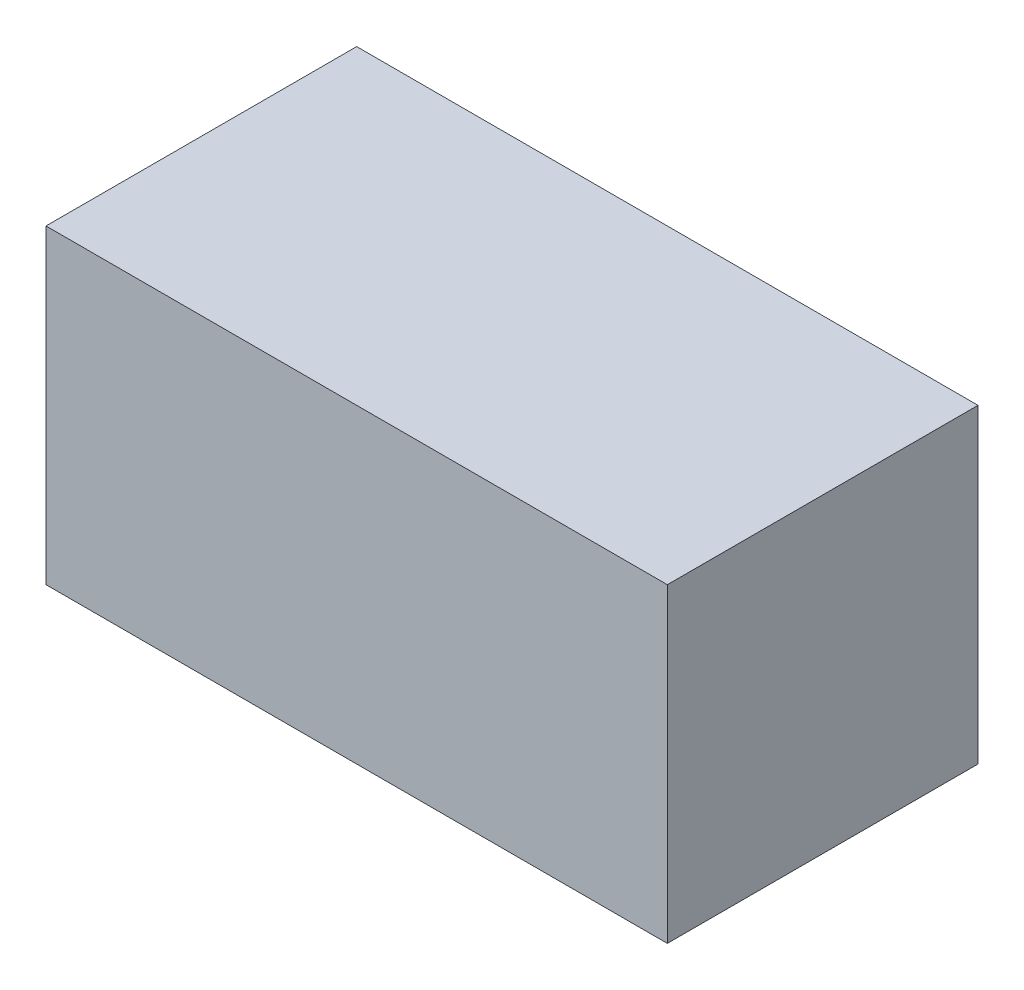
ISO-10303-21;
HEADER;
FILE_DESCRIPTION(('STEP AP214'),'2;1');
FILE_NAME('part.step','',(''),(''),'','','');
FILE_SCHEMA(('AUTOMOTIVE_DESIGN { 1 0 10303 214 1 1 1 1 }'));
ENDSEC;
DATA;
#1=APPLICATION_CONTEXT('core data for automotive mechanical design processes');
#2=APPLICATION_PROTOCOL_DEFINITION('international standard','automotive_design',2000,#1);
#3=PRODUCT_CONTEXT('',#1,'mechanical');
#4=PRODUCT('Part','Part','',(#3));
#5=PRODUCT_RELATED_PRODUCT_CATEGORY('part','',(#4));
#6=PRODUCT_DEFINITION_FORMATION('','',#4);
#7=PRODUCT_DEFINITION_CONTEXT('part definition',#1,'design');
#8=PRODUCT_DEFINITION('design','',#6,#7);
#9=PRODUCT_DEFINITION_SHAPE('','',#8);
#10=(LENGTH_UNIT() NAMED_UNIT(*) SI_UNIT(.MILLI.,.METRE.));
#11=(NAMED_UNIT(*) PLANE_ANGLE_UNIT() SI_UNIT($,.RADIAN.));
#12=(NAMED_UNIT(*) SI_UNIT($,.STERADIAN.) SOLID_ANGLE_UNIT());
#13=UNCERTAINTY_MEASURE_WITH_UNIT(LENGTH_MEASURE(1.E-05),#10,'distance_accuracy_value','');
#14=(GEOMETRIC_REPRESENTATION_CONTEXT(3) GLOBAL_UNCERTAINTY_ASSIGNED_CONTEXT((#13)) GLOBAL_UNIT_ASSIGNED_CONTEXT((#10,
#11,#12)) REPRESENTATION_CONTEXT('',''));
#15=CARTESIAN_POINT('',(0.,0.,0.));
#16=DIRECTION('',(0.,0.,1.));
#17=DIRECTION('',(1.,0.,0.));
#18=AXIS2_PLACEMENT_3D('',#15,#16,#17);
#19=CARTESIAN_POINT('',(10.,5.,5.));
#20=DIRECTION('',(-1.,0.,0.));
#21=DIRECTION('',(0.,0.,1.));
#22=AXIS2_PLACEMENT_3D('',#19,#20,#21);
#23=PLANE('',#22);
#24=DIRECTION('',(0.,0.,-1.));
#25=VECTOR('',#24,1.);
#26=CARTESIAN_POINT('',(10.,-5.,5.));
#27=LINE('',#26,#25);
#28=CARTESIAN_POINT('',(10.,-5.,5.));
#29=VERTEX_POINT('',#28);
#30=CARTESIAN_POINT('',(10.,-5.,-5.));
#31=VERTEX_POINT('',#30);
#32=EDGE_CURVE('E96',#29,#31,#27,.T.);
#33=ORIENTED_EDGE('',*,*,#32,.T.);
#34=DIRECTION('',(0.,-1.,0.));
#35=VECTOR('',#34,1.);
#36=CARTESIAN_POINT('',(10.,5.,-5.));
#37=LINE('',#36,#35);
#38=CARTESIAN_POINT('',(10.,5.,-5.));
#39=VERTEX_POINT('',#38);
#40=EDGE_CURVE('E11',#39,#31,#37,.T.);
#41=ORIENTED_EDGE('',*,*,#40,.F.);
#42=DIRECTION('',(0.,0.,-1.));
#43=VECTOR('',#42,1.);
#44=CARTESIAN_POINT('',(10.,5.,5.));
#45=LINE('',#44,#43);
#46=CARTESIAN_POINT('',(10.,5.,5.));
#47=VERTEX_POINT('',#46);
#48=EDGE_CURVE('E84',#47,#39,#45,.T.);
#49=ORIENTED_EDGE('',*,*,#48,.F.);
#50=DIRECTION('',(0.,-1.,0.));
#51=VECTOR('',#50,1.);
#52=CARTESIAN_POINT('',(10.,5.,5.));
#53=LINE('',#52,#51);
#54=EDGE_CURVE('E92',#47,#29,#53,.T.);
#55=ORIENTED_EDGE('',*,*,#54,.T.);
#56=EDGE_LOOP('',(#33,#41,#49,#55));
#57=FACE_BOUND('',#56,.T.);
#58=ADVANCED_FACE('F33',(#57),#23,.F.);
#59=CARTESIAN_POINT('',(-10.,5.,-5.));
#60=DIRECTION('',(0.,0.,1.));
#61=DIRECTION('',(1.,0.,0.));
#62=AXIS2_PLACEMENT_3D('',#59,#60,#61);
#63=PLANE('',#62);
#64=DIRECTION('',(-1.,0.,0.));
#65=VECTOR('',#64,1.);
#66=CARTESIAN_POINT('',(-10.,-5.,-5.));
#67=LINE('',#66,#65);
#68=CARTESIAN_POINT('',(-10.,-5.,-5.));
#69=VERTEX_POINT('',#68);
#70=EDGE_CURVE('E88',#31,#69,#67,.T.);
#71=ORIENTED_EDGE('',*,*,#70,.T.);
#72=DIRECTION('',(0.,-1.,0.));
#73=VECTOR('',#72,1.);
#74=CARTESIAN_POINT('',(-10.,5.,-5.));
#75=LINE('',#74,#73);
#76=CARTESIAN_POINT('',(-10.,5.,-5.));
#77=VERTEX_POINT('',#76);
#78=EDGE_CURVE('E41',#77,#69,#75,.T.);
#79=ORIENTED_EDGE('',*,*,#78,.F.);
#80=DIRECTION('',(-1.,0.,0.));
#81=VECTOR('',#80,1.);
#82=CARTESIAN_POINT('',(-10.,5.,-5.));
#83=LINE('',#82,#81);
#84=EDGE_CURVE('E79',#39,#77,#83,.T.);
#85=ORIENTED_EDGE('',*,*,#84,.F.);
#86=ORIENTED_EDGE('',*,*,#40,.T.);
#87=EDGE_LOOP('',(#71,#79,#85,#86));
#88=FACE_BOUND('',#87,.T.);
#89=ADVANCED_FACE('F87',(#88),#63,.F.);
#90=CARTESIAN_POINT('',(-10.,5.,5.));
#91=DIRECTION('',(1.,0.,0.));
#92=DIRECTION('',(0.,0.,-1.));
#93=AXIS2_PLACEMENT_3D('',#90,#91,#92);
#94=PLANE('',#93);
#95=DIRECTION('',(0.,0.,1.));
#96=VECTOR('',#95,1.);
#97=CARTESIAN_POINT('',(-10.,-5.,5.));
#98=LINE('',#97,#96);
#99=CARTESIAN_POINT('',(-10.,-5.,5.));
#100=VERTEX_POINT('',#99);
#101=EDGE_CURVE('E66',#69,#100,#98,.T.);
#102=ORIENTED_EDGE('',*,*,#101,.T.);
#103=DIRECTION('',(0.,-1.,0.));
#104=VECTOR('',#103,1.);
#105=CARTESIAN_POINT('',(-10.,5.,5.));
#106=LINE('',#105,#104);
#107=CARTESIAN_POINT('',(-10.,5.,5.));
#108=VERTEX_POINT('',#107);
#109=EDGE_CURVE('E89',#108,#100,#106,.T.);
#110=ORIENTED_EDGE('',*,*,#109,.F.);
#111=DIRECTION('',(0.,0.,1.));
#112=VECTOR('',#111,1.);
#113=CARTESIAN_POINT('',(-10.,5.,5.));
#114=LINE('',#113,#112);
#115=EDGE_CURVE('E82',#77,#108,#114,.T.);
#116=ORIENTED_EDGE('',*,*,#115,.F.);
#117=ORIENTED_EDGE('',*,*,#78,.T.);
#118=EDGE_LOOP('',(#102,#110,#116,#117));
#119=FACE_BOUND('',#118,.T.);
#120=ADVANCED_FACE('F90',(#119),#94,.F.);
#121=CARTESIAN_POINT('',(-10.,5.,5.));
#122=DIRECTION('',(0.,0.,-1.));
#123=DIRECTION('',(-1.,0.,0.));
#124=AXIS2_PLACEMENT_3D('',#121,#122,#123);
#125=PLANE('',#124);
#126=DIRECTION('',(1.,0.,0.));
#127=VECTOR('',#126,1.);
#128=CARTESIAN_POINT('',(-10.,-5.,5.));
#129=LINE('',#128,#127);
#130=EDGE_CURVE('E72',#100,#29,#129,.T.);
#131=ORIENTED_EDGE('',*,*,#130,.T.);
#132=ORIENTED_EDGE('',*,*,#54,.F.);
#133=DIRECTION('',(1.,0.,0.));
#134=VECTOR('',#133,1.);
#135=CARTESIAN_POINT('',(-10.,5.,5.));
#136=LINE('',#135,#134);
#137=EDGE_CURVE('E49',#108,#47,#136,.T.);
#138=ORIENTED_EDGE('',*,*,#137,.F.);
#139=ORIENTED_EDGE('',*,*,#109,.T.);
#140=EDGE_LOOP('',(#131,#132,#138,#139));
#141=FACE_BOUND('',#140,.T.);
#142=ADVANCED_FACE('F103',(#141),#125,.F.);
#143=CARTESIAN_POINT('',(0.,5.,0.));
#144=DIRECTION('',(0.,-1.,0.));
#145=DIRECTION('',(0.,0.,-1.));
#146=AXIS2_PLACEMENT_3D('',#143,#144,#145);
#147=PLANE('',#146);
#148=ORIENTED_EDGE('',*,*,#48,.T.);
#149=ORIENTED_EDGE('',*,*,#84,.T.);
#150=ORIENTED_EDGE('',*,*,#115,.T.);
#151=ORIENTED_EDGE('',*,*,#137,.T.);
#152=EDGE_LOOP('',(#148,#149,#150,#151));
#153=FACE_BOUND('',#152,.T.);
#154=ADVANCED_FACE('F80',(#153),#147,.F.);
#155=CARTESIAN_POINT('',(0.,-5.,0.));
#156=DIRECTION('',(0.,-1.,0.));
#157=DIRECTION('',(0.,0.,-1.));
#158=AXIS2_PLACEMENT_3D('',#155,#156,#157);
#159=PLANE('',#158);
#160=ORIENTED_EDGE('',*,*,#32,.F.);
#161=ORIENTED_EDGE('',*,*,#130,.F.);
#162=ORIENTED_EDGE('',*,*,#101,.F.);
#163=ORIENTED_EDGE('',*,*,#70,.F.);
#164=EDGE_LOOP('',(#160,#161,#162,#163));
#165=FACE_BOUND('',#164,.T.);
#166=ADVANCED_FACE('F106',(#165),#159,.T.);
#167=CLOSED_SHELL('',(#58,#89,#120,#142,#154,#166));
#168=MANIFOLD_SOLID_BREP('B2',#167);
#169=ADVANCED_BREP_SHAPE_REPRESENTATION('',(#18,#168),#14);
#170=SHAPE_DEFINITION_REPRESENTATION(#9,#169);
ENDSEC;
END-ISO-10303-21;
